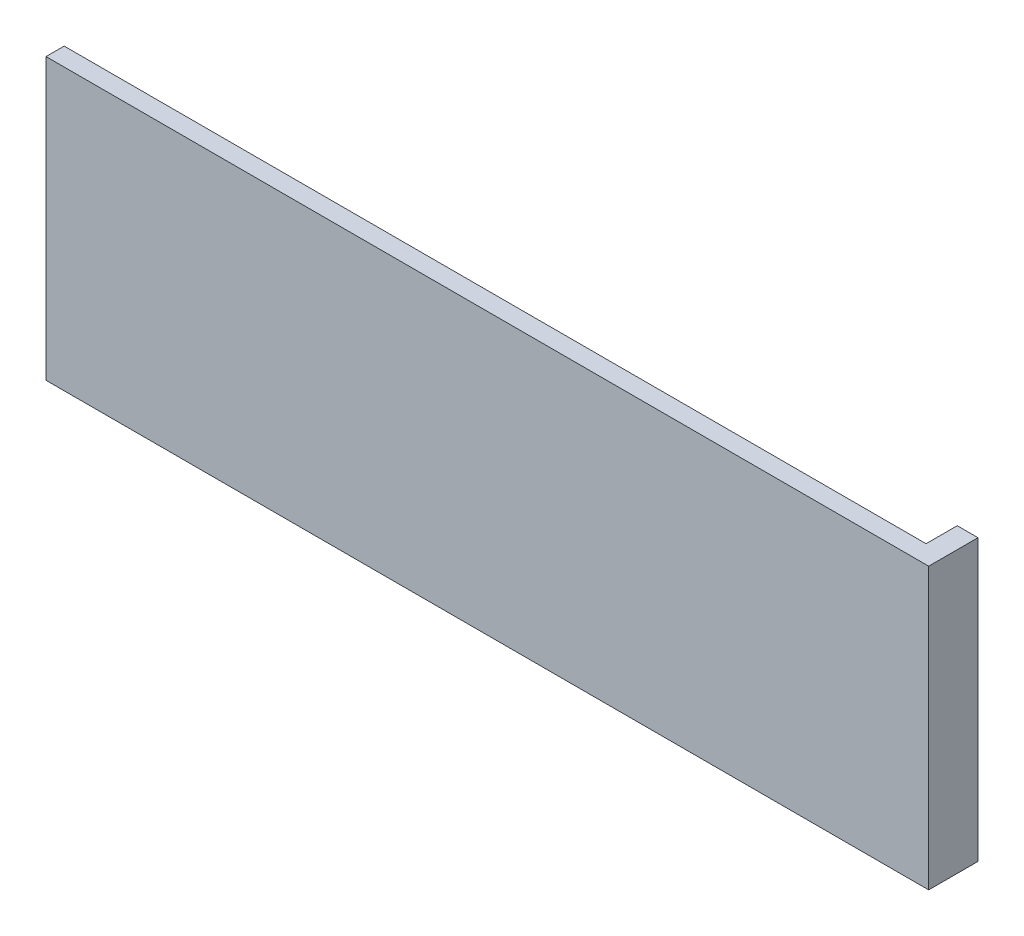
ISO-10303-21;
HEADER;
FILE_DESCRIPTION(('STEP AP214'),'2;1');
FILE_NAME('part.step','',(''),(''),'','','');
FILE_SCHEMA(('AUTOMOTIVE_DESIGN { 1 0 10303 214 1 1 1 1 }'));
ENDSEC;
DATA;
#1=APPLICATION_CONTEXT('core data for automotive mechanical design processes');
#2=APPLICATION_PROTOCOL_DEFINITION('international standard','automotive_design',2000,#1);
#3=PRODUCT_CONTEXT('',#1,'mechanical');
#4=PRODUCT('Part','Part','',(#3));
#5=PRODUCT_RELATED_PRODUCT_CATEGORY('part','',(#4));
#6=PRODUCT_DEFINITION_FORMATION('','',#4);
#7=PRODUCT_DEFINITION_CONTEXT('part definition',#1,'design');
#8=PRODUCT_DEFINITION('design','',#6,#7);
#9=PRODUCT_DEFINITION_SHAPE('','',#8);
#10=(LENGTH_UNIT() NAMED_UNIT(*) SI_UNIT(.MILLI.,.METRE.));
#11=(NAMED_UNIT(*) PLANE_ANGLE_UNIT() SI_UNIT($,.RADIAN.));
#12=(NAMED_UNIT(*) SI_UNIT($,.STERADIAN.) SOLID_ANGLE_UNIT());
#13=UNCERTAINTY_MEASURE_WITH_UNIT(LENGTH_MEASURE(1.E-05),#10,'distance_accuracy_value','');
#14=(GEOMETRIC_REPRESENTATION_CONTEXT(3) GLOBAL_UNCERTAINTY_ASSIGNED_CONTEXT((#13)) GLOBAL_UNIT_ASSIGNED_CONTEXT((#10,
#11,#12)) REPRESENTATION_CONTEXT('',''));
#15=CARTESIAN_POINT('',(0.,0.,0.));
#16=DIRECTION('',(0.,0.,1.));
#17=DIRECTION('',(1.,0.,0.));
#18=AXIS2_PLACEMENT_3D('',#15,#16,#17);
#19=CARTESIAN_POINT('',(0.,0.,0.));
#20=DIRECTION('',(0.,0.,1.));
#21=DIRECTION('',(1.,0.,0.));
#22=AXIS2_PLACEMENT_3D('',#19,#20,#21);
#23=PLANE('',#22);
#24=DIRECTION('',(0.,1.,0.));
#25=VECTOR('',#24,1.);
#26=CARTESIAN_POINT('',(0.,27.,0.));
#27=LINE('',#26,#25);
#28=CARTESIAN_POINT('',(0.,0.,0.));
#29=VERTEX_POINT('',#28);
#30=CARTESIAN_POINT('',(0.,27.,0.));
#31=VERTEX_POINT('',#30);
#32=EDGE_CURVE('E49',#29,#31,#27,.T.);
#33=ORIENTED_EDGE('',*,*,#32,.F.);
#34=DIRECTION('',(1.,0.,0.));
#35=VECTOR('',#34,1.);
#36=CARTESIAN_POINT('',(0.,0.,0.));
#37=LINE('',#36,#35);
#38=CARTESIAN_POINT('',(-83.,0.,0.));
#39=VERTEX_POINT('',#38);
#40=EDGE_CURVE('E135',#39,#29,#37,.T.);
#41=ORIENTED_EDGE('',*,*,#40,.F.);
#42=DIRECTION('',(0.,-1.,0.));
#43=VECTOR('',#42,1.);
#44=CARTESIAN_POINT('',(-83.,0.,0.));
#45=LINE('',#44,#43);
#46=CARTESIAN_POINT('',(-83.,27.,0.));
#47=VERTEX_POINT('',#46);
#48=EDGE_CURVE('E78',#47,#39,#45,.T.);
#49=ORIENTED_EDGE('',*,*,#48,.F.);
#50=DIRECTION('',(-1.,0.,0.));
#51=VECTOR('',#50,1.);
#52=CARTESIAN_POINT('',(0.,27.,0.));
#53=LINE('',#52,#51);
#54=EDGE_CURVE('E83',#31,#47,#53,.T.);
#55=ORIENTED_EDGE('',*,*,#54,.F.);
#56=EDGE_LOOP('',(#33,#41,#49,#55));
#57=FACE_BOUND('',#56,.T.);
#58=ADVANCED_FACE('F34',(#57),#23,.F.);
#59=CARTESIAN_POINT('',(2.,0.,1.75));
#60=DIRECTION('',(-1.,0.,0.));
#61=DIRECTION('',(0.,0.,1.));
#62=AXIS2_PLACEMENT_3D('',#59,#60,#61);
#63=PLANE('',#62);
#64=DIRECTION('',(0.,0.,-1.));
#65=VECTOR('',#64,1.);
#66=CARTESIAN_POINT('',(2.,0.,1.75));
#67=LINE('',#66,#65);
#68=CARTESIAN_POINT('',(2.,0.,1.75));
#69=VERTEX_POINT('',#68);
#70=CARTESIAN_POINT('',(2.,0.,-3.));
#71=VERTEX_POINT('',#70);
#72=EDGE_CURVE('E99',#69,#71,#67,.T.);
#73=ORIENTED_EDGE('',*,*,#72,.T.);
#74=DIRECTION('',(0.,-1.,0.));
#75=VECTOR('',#74,1.);
#76=CARTESIAN_POINT('',(2.,27.,-3.));
#77=LINE('',#76,#75);
#78=CARTESIAN_POINT('',(2.,27.,-3.));
#79=VERTEX_POINT('',#78);
#80=EDGE_CURVE('E103',#79,#71,#77,.T.);
#81=ORIENTED_EDGE('',*,*,#80,.F.);
#82=DIRECTION('',(0.,0.,-1.));
#83=VECTOR('',#82,1.);
#84=CARTESIAN_POINT('',(2.,27.,1.75));
#85=LINE('',#84,#83);
#86=CARTESIAN_POINT('',(2.,27.,1.75));
#87=VERTEX_POINT('',#86);
#88=EDGE_CURVE('E12',#87,#79,#85,.T.);
#89=ORIENTED_EDGE('',*,*,#88,.F.);
#90=DIRECTION('',(0.,1.,0.));
#91=VECTOR('',#90,1.);
#92=CARTESIAN_POINT('',(2.,0.,1.75));
#93=LINE('',#92,#91);
#94=EDGE_CURVE('E104',#69,#87,#93,.T.);
#95=ORIENTED_EDGE('',*,*,#94,.F.);
#96=EDGE_LOOP('',(#73,#81,#89,#95));
#97=FACE_BOUND('',#96,.T.);
#98=ADVANCED_FACE('F36',(#97),#63,.F.);
#99=CARTESIAN_POINT('',(0.,27.,1.75));
#100=DIRECTION('',(0.,-1.,0.));
#101=DIRECTION('',(1.,0.,0.));
#102=AXIS2_PLACEMENT_3D('',#99,#100,#101);
#103=PLANE('',#102);
#104=ORIENTED_EDGE('',*,*,#88,.T.);
#105=DIRECTION('',(1.,0.,0.));
#106=VECTOR('',#105,1.);
#107=CARTESIAN_POINT('',(2.,27.,-3.));
#108=LINE('',#107,#106);
#109=CARTESIAN_POINT('',(0.,27.,-3.));
#110=VERTEX_POINT('',#109);
#111=EDGE_CURVE('E120',#110,#79,#108,.T.);
#112=ORIENTED_EDGE('',*,*,#111,.F.);
#113=DIRECTION('',(0.,0.,1.));
#114=VECTOR('',#113,1.);
#115=CARTESIAN_POINT('',(0.,27.,-3.));
#116=LINE('',#115,#114);
#117=EDGE_CURVE('E125',#110,#31,#116,.T.);
#118=ORIENTED_EDGE('',*,*,#117,.T.);
#119=ORIENTED_EDGE('',*,*,#54,.T.);
#120=DIRECTION('',(0.,0.,-1.));
#121=VECTOR('',#120,1.);
#122=CARTESIAN_POINT('',(-83.,27.,1.75));
#123=LINE('',#122,#121);
#124=CARTESIAN_POINT('',(-83.,27.,1.75));
#125=VERTEX_POINT('',#124);
#126=EDGE_CURVE('E42',#125,#47,#123,.T.);
#127=ORIENTED_EDGE('',*,*,#126,.F.);
#128=DIRECTION('',(-1.,0.,0.));
#129=VECTOR('',#128,1.);
#130=CARTESIAN_POINT('',(0.,27.,1.75));
#131=LINE('',#130,#129);
#132=EDGE_CURVE('E70',#87,#125,#131,.T.);
#133=ORIENTED_EDGE('',*,*,#132,.F.);
#134=EDGE_LOOP('',(#104,#112,#118,#119,#127,#133));
#135=FACE_BOUND('',#134,.T.);
#136=ADVANCED_FACE('F139',(#135),#103,.F.);
#137=CARTESIAN_POINT('',(-83.,0.,1.75));
#138=DIRECTION('',(1.,0.,0.));
#139=DIRECTION('',(0.,0.,-1.));
#140=AXIS2_PLACEMENT_3D('',#137,#138,#139);
#141=PLANE('',#140);
#142=ORIENTED_EDGE('',*,*,#48,.T.);
#143=DIRECTION('',(0.,0.,-1.));
#144=VECTOR('',#143,1.);
#145=CARTESIAN_POINT('',(-83.,0.,1.75));
#146=LINE('',#145,#144);
#147=CARTESIAN_POINT('',(-83.,0.,1.75));
#148=VERTEX_POINT('',#147);
#149=EDGE_CURVE('E106',#148,#39,#146,.T.);
#150=ORIENTED_EDGE('',*,*,#149,.F.);
#151=DIRECTION('',(0.,-1.,0.));
#152=VECTOR('',#151,1.);
#153=CARTESIAN_POINT('',(-83.,0.,1.75));
#154=LINE('',#153,#152);
#155=EDGE_CURVE('E130',#125,#148,#154,.T.);
#156=ORIENTED_EDGE('',*,*,#155,.F.);
#157=ORIENTED_EDGE('',*,*,#126,.T.);
#158=EDGE_LOOP('',(#142,#150,#156,#157));
#159=FACE_BOUND('',#158,.T.);
#160=ADVANCED_FACE('F159',(#159),#141,.F.);
#161=CARTESIAN_POINT('',(0.,0.,1.75));
#162=DIRECTION('',(0.,1.,0.));
#163=DIRECTION('',(0.,0.,1.));
#164=AXIS2_PLACEMENT_3D('',#161,#162,#163);
#165=PLANE('',#164);
#166=ORIENTED_EDGE('',*,*,#40,.T.);
#167=DIRECTION('',(0.,0.,1.));
#168=VECTOR('',#167,1.);
#169=CARTESIAN_POINT('',(0.,0.,-3.));
#170=LINE('',#169,#168);
#171=CARTESIAN_POINT('',(0.,0.,-3.));
#172=VERTEX_POINT('',#171);
#173=EDGE_CURVE('E112',#172,#29,#170,.T.);
#174=ORIENTED_EDGE('',*,*,#173,.F.);
#175=DIRECTION('',(-1.,0.,0.));
#176=VECTOR('',#175,1.);
#177=CARTESIAN_POINT('',(2.,0.,-3.));
#178=LINE('',#177,#176);
#179=EDGE_CURVE('E109',#71,#172,#178,.T.);
#180=ORIENTED_EDGE('',*,*,#179,.F.);
#181=ORIENTED_EDGE('',*,*,#72,.F.);
#182=DIRECTION('',(1.,0.,0.));
#183=VECTOR('',#182,1.);
#184=CARTESIAN_POINT('',(0.,0.,1.75));
#185=LINE('',#184,#183);
#186=EDGE_CURVE('E58',#148,#69,#185,.T.);
#187=ORIENTED_EDGE('',*,*,#186,.F.);
#188=ORIENTED_EDGE('',*,*,#149,.T.);
#189=EDGE_LOOP('',(#166,#174,#180,#181,#187,#188));
#190=FACE_BOUND('',#189,.T.);
#191=ADVANCED_FACE('F110',(#190),#165,.F.);
#192=CARTESIAN_POINT('',(0.,0.,1.75));
#193=DIRECTION('',(0.,0.,1.));
#194=DIRECTION('',(1.,0.,0.));
#195=AXIS2_PLACEMENT_3D('',#192,#193,#194);
#196=PLANE('',#195);
#197=ORIENTED_EDGE('',*,*,#94,.T.);
#198=ORIENTED_EDGE('',*,*,#132,.T.);
#199=ORIENTED_EDGE('',*,*,#155,.T.);
#200=ORIENTED_EDGE('',*,*,#186,.T.);
#201=EDGE_LOOP('',(#197,#198,#199,#200));
#202=FACE_BOUND('',#201,.T.);
#203=ADVANCED_FACE('F138',(#202),#196,.T.);
#204=CARTESIAN_POINT('',(0.,27.,-3.));
#205=DIRECTION('',(1.,0.,0.));
#206=DIRECTION('',(0.,0.,-1.));
#207=AXIS2_PLACEMENT_3D('',#204,#205,#206);
#208=PLANE('',#207);
#209=ORIENTED_EDGE('',*,*,#32,.T.);
#210=ORIENTED_EDGE('',*,*,#117,.F.);
#211=DIRECTION('',(0.,1.,0.));
#212=VECTOR('',#211,1.);
#213=CARTESIAN_POINT('',(0.,27.,-3.));
#214=LINE('',#213,#212);
#215=EDGE_CURVE('E115',#172,#110,#214,.T.);
#216=ORIENTED_EDGE('',*,*,#215,.F.);
#217=ORIENTED_EDGE('',*,*,#173,.T.);
#218=EDGE_LOOP('',(#209,#210,#216,#217));
#219=FACE_BOUND('',#218,.T.);
#220=ADVANCED_FACE('F142',(#219),#208,.F.);
#221=CARTESIAN_POINT('',(0.,0.,-3.));
#222=DIRECTION('',(0.,0.,-1.));
#223=DIRECTION('',(-1.,0.,0.));
#224=AXIS2_PLACEMENT_3D('',#221,#222,#223);
#225=PLANE('',#224);
#226=ORIENTED_EDGE('',*,*,#80,.T.);
#227=ORIENTED_EDGE('',*,*,#179,.T.);
#228=ORIENTED_EDGE('',*,*,#215,.T.);
#229=ORIENTED_EDGE('',*,*,#111,.T.);
#230=EDGE_LOOP('',(#226,#227,#228,#229));
#231=FACE_BOUND('',#230,.T.);
#232=ADVANCED_FACE('F118',(#231),#225,.T.);
#233=CLOSED_SHELL('',(#58,#98,#136,#160,#191,#203,#220,#232));
#234=MANIFOLD_SOLID_BREP('B2',#233);
#235=ADVANCED_BREP_SHAPE_REPRESENTATION('',(#18,#234),#14);
#236=SHAPE_DEFINITION_REPRESENTATION(#9,#235);
ENDSEC;
END-ISO-10303-21;
